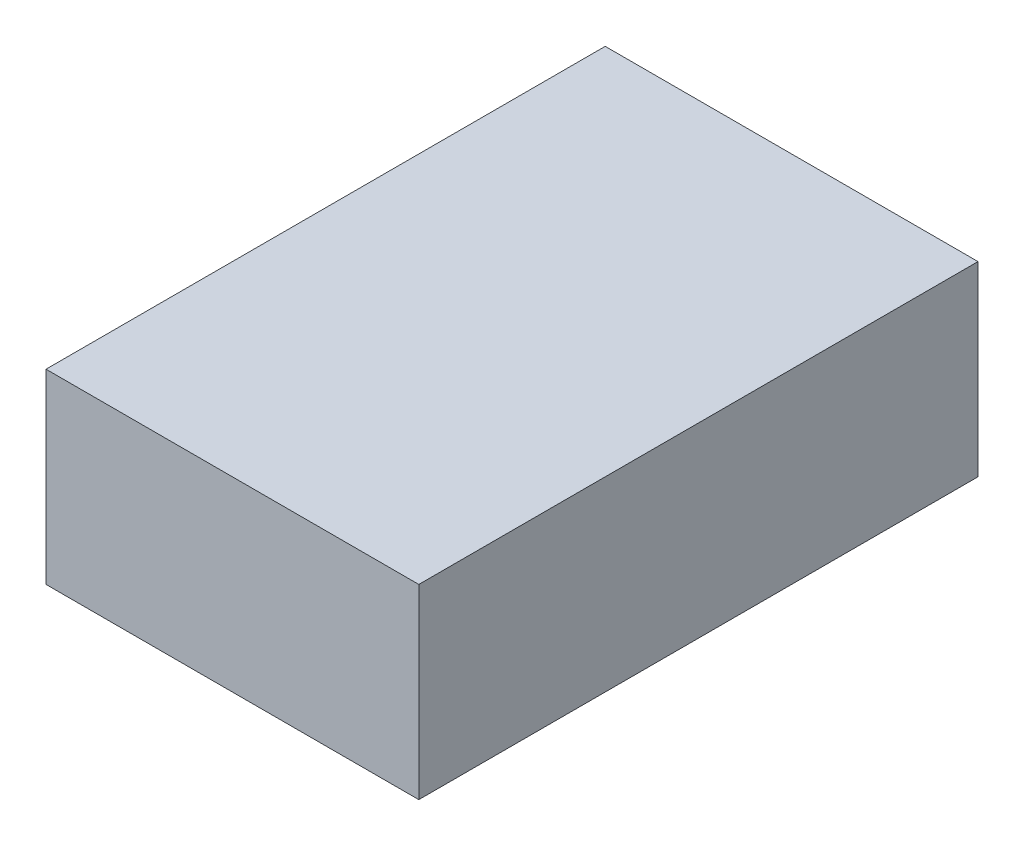
ISO-10303-21;
HEADER;
FILE_DESCRIPTION(('STEP AP214'),'2;1');
FILE_NAME('part.step','',(''),(''),'','','');
FILE_SCHEMA(('AUTOMOTIVE_DESIGN { 1 0 10303 214 1 1 1 1 }'));
ENDSEC;
DATA;
#1=APPLICATION_CONTEXT('core data for automotive mechanical design processes');
#2=APPLICATION_PROTOCOL_DEFINITION('international standard','automotive_design',2000,#1);
#3=PRODUCT_CONTEXT('',#1,'mechanical');
#4=PRODUCT('Part','Part','',(#3));
#5=PRODUCT_RELATED_PRODUCT_CATEGORY('part','',(#4));
#6=PRODUCT_DEFINITION_FORMATION('','',#4);
#7=PRODUCT_DEFINITION_CONTEXT('part definition',#1,'design');
#8=PRODUCT_DEFINITION('design','',#6,#7);
#9=PRODUCT_DEFINITION_SHAPE('','',#8);
#10=(LENGTH_UNIT() NAMED_UNIT(*) SI_UNIT(.MILLI.,.METRE.));
#11=(NAMED_UNIT(*) PLANE_ANGLE_UNIT() SI_UNIT($,.RADIAN.));
#12=(NAMED_UNIT(*) SI_UNIT($,.STERADIAN.) SOLID_ANGLE_UNIT());
#13=UNCERTAINTY_MEASURE_WITH_UNIT(LENGTH_MEASURE(1.E-05),#10,'distance_accuracy_value','');
#14=(GEOMETRIC_REPRESENTATION_CONTEXT(3) GLOBAL_UNCERTAINTY_ASSIGNED_CONTEXT((#13)) GLOBAL_UNIT_ASSIGNED_CONTEXT((#10,
#11,#12)) REPRESENTATION_CONTEXT('',''));
#15=CARTESIAN_POINT('',(0.,0.,0.));
#16=DIRECTION('',(0.,0.,1.));
#17=DIRECTION('',(1.,0.,0.));
#18=AXIS2_PLACEMENT_3D('',#15,#16,#17);
#19=CARTESIAN_POINT('',(100.,50.,300.));
#20=DIRECTION('',(-1.,0.,0.));
#21=DIRECTION('',(0.,-1.,0.));
#22=AXIS2_PLACEMENT_3D('',#19,#20,#21);
#23=PLANE('',#22);
#24=DIRECTION('',(0.,1.,0.));
#25=VECTOR('',#24,1.);
#26=CARTESIAN_POINT('',(100.,50.,0.));
#27=LINE('',#26,#25);
#28=CARTESIAN_POINT('',(100.,-50.,0.));
#29=VERTEX_POINT('',#28);
#30=CARTESIAN_POINT('',(100.,50.,0.));
#31=VERTEX_POINT('',#30);
#32=EDGE_CURVE('E103',#29,#31,#27,.T.);
#33=ORIENTED_EDGE('',*,*,#32,.T.);
#34=DIRECTION('',(0.,0.,-1.));
#35=VECTOR('',#34,1.);
#36=CARTESIAN_POINT('',(100.,50.,300.));
#37=LINE('',#36,#35);
#38=CARTESIAN_POINT('',(100.,50.,300.));
#39=VERTEX_POINT('',#38);
#40=EDGE_CURVE('E11',#39,#31,#37,.T.);
#41=ORIENTED_EDGE('',*,*,#40,.F.);
#42=DIRECTION('',(0.,1.,0.));
#43=VECTOR('',#42,1.);
#44=CARTESIAN_POINT('',(100.,50.,300.));
#45=LINE('',#44,#43);
#46=CARTESIAN_POINT('',(100.,-50.,300.));
#47=VERTEX_POINT('',#46);
#48=EDGE_CURVE('E91',#47,#39,#45,.T.);
#49=ORIENTED_EDGE('',*,*,#48,.F.);
#50=DIRECTION('',(0.,0.,-1.));
#51=VECTOR('',#50,1.);
#52=CARTESIAN_POINT('',(100.,-50.,300.));
#53=LINE('',#52,#51);
#54=EDGE_CURVE('E99',#47,#29,#53,.T.);
#55=ORIENTED_EDGE('',*,*,#54,.T.);
#56=EDGE_LOOP('',(#33,#41,#49,#55));
#57=FACE_BOUND('',#56,.T.);
#58=ADVANCED_FACE('F40',(#57),#23,.F.);
#59=CARTESIAN_POINT('',(-100.,50.,300.));
#60=DIRECTION('',(0.,-1.,0.));
#61=DIRECTION('',(0.,0.,-1.));
#62=AXIS2_PLACEMENT_3D('',#59,#60,#61);
#63=PLANE('',#62);
#64=DIRECTION('',(-1.,0.,0.));
#65=VECTOR('',#64,1.);
#66=CARTESIAN_POINT('',(-100.,50.,0.));
#67=LINE('',#66,#65);
#68=CARTESIAN_POINT('',(-100.,50.,0.));
#69=VERTEX_POINT('',#68);
#70=EDGE_CURVE('E95',#31,#69,#67,.T.);
#71=ORIENTED_EDGE('',*,*,#70,.T.);
#72=DIRECTION('',(0.,0.,-1.));
#73=VECTOR('',#72,1.);
#74=CARTESIAN_POINT('',(-100.,50.,300.));
#75=LINE('',#74,#73);
#76=CARTESIAN_POINT('',(-100.,50.,300.));
#77=VERTEX_POINT('',#76);
#78=EDGE_CURVE('E48',#77,#69,#75,.T.);
#79=ORIENTED_EDGE('',*,*,#78,.F.);
#80=DIRECTION('',(-1.,0.,0.));
#81=VECTOR('',#80,1.);
#82=CARTESIAN_POINT('',(-100.,50.,300.));
#83=LINE('',#82,#81);
#84=EDGE_CURVE('E86',#39,#77,#83,.T.);
#85=ORIENTED_EDGE('',*,*,#84,.F.);
#86=ORIENTED_EDGE('',*,*,#40,.T.);
#87=EDGE_LOOP('',(#71,#79,#85,#86));
#88=FACE_BOUND('',#87,.T.);
#89=ADVANCED_FACE('F94',(#88),#63,.F.);
#90=CARTESIAN_POINT('',(-100.,50.,300.));
#91=DIRECTION('',(1.,0.,0.));
#92=DIRECTION('',(0.,1.,0.));
#93=AXIS2_PLACEMENT_3D('',#90,#91,#92);
#94=PLANE('',#93);
#95=DIRECTION('',(0.,-1.,0.));
#96=VECTOR('',#95,1.);
#97=CARTESIAN_POINT('',(-100.,50.,0.));
#98=LINE('',#97,#96);
#99=CARTESIAN_POINT('',(-100.,-50.,0.));
#100=VERTEX_POINT('',#99);
#101=EDGE_CURVE('E73',#69,#100,#98,.T.);
#102=ORIENTED_EDGE('',*,*,#101,.T.);
#103=DIRECTION('',(0.,0.,-1.));
#104=VECTOR('',#103,1.);
#105=CARTESIAN_POINT('',(-100.,-50.,300.));
#106=LINE('',#105,#104);
#107=CARTESIAN_POINT('',(-100.,-50.,300.));
#108=VERTEX_POINT('',#107);
#109=EDGE_CURVE('E96',#108,#100,#106,.T.);
#110=ORIENTED_EDGE('',*,*,#109,.F.);
#111=DIRECTION('',(0.,-1.,0.));
#112=VECTOR('',#111,1.);
#113=CARTESIAN_POINT('',(-100.,50.,300.));
#114=LINE('',#113,#112);
#115=EDGE_CURVE('E89',#77,#108,#114,.T.);
#116=ORIENTED_EDGE('',*,*,#115,.F.);
#117=ORIENTED_EDGE('',*,*,#78,.T.);
#118=EDGE_LOOP('',(#102,#110,#116,#117));
#119=FACE_BOUND('',#118,.T.);
#120=ADVANCED_FACE('F97',(#119),#94,.F.);
#121=CARTESIAN_POINT('',(-100.,-50.,300.));
#122=DIRECTION('',(0.,1.,0.));
#123=DIRECTION('',(0.,0.,1.));
#124=AXIS2_PLACEMENT_3D('',#121,#122,#123);
#125=PLANE('',#124);
#126=DIRECTION('',(1.,0.,0.));
#127=VECTOR('',#126,1.);
#128=CARTESIAN_POINT('',(-100.,-50.,0.));
#129=LINE('',#128,#127);
#130=EDGE_CURVE('E79',#100,#29,#129,.T.);
#131=ORIENTED_EDGE('',*,*,#130,.T.);
#132=ORIENTED_EDGE('',*,*,#54,.F.);
#133=DIRECTION('',(1.,0.,0.));
#134=VECTOR('',#133,1.);
#135=CARTESIAN_POINT('',(-100.,-50.,300.));
#136=LINE('',#135,#134);
#137=EDGE_CURVE('E56',#108,#47,#136,.T.);
#138=ORIENTED_EDGE('',*,*,#137,.F.);
#139=ORIENTED_EDGE('',*,*,#109,.T.);
#140=EDGE_LOOP('',(#131,#132,#138,#139));
#141=FACE_BOUND('',#140,.T.);
#142=ADVANCED_FACE('F110',(#141),#125,.F.);
#143=CARTESIAN_POINT('',(0.,0.,300.));
#144=DIRECTION('',(0.,0.,1.));
#145=DIRECTION('',(1.,0.,0.));
#146=AXIS2_PLACEMENT_3D('',#143,#144,#145);
#147=PLANE('',#146);
#148=ORIENTED_EDGE('',*,*,#48,.T.);
#149=ORIENTED_EDGE('',*,*,#84,.T.);
#150=ORIENTED_EDGE('',*,*,#115,.T.);
#151=ORIENTED_EDGE('',*,*,#137,.T.);
#152=EDGE_LOOP('',(#148,#149,#150,#151));
#153=FACE_BOUND('',#152,.T.);
#154=ADVANCED_FACE('F87',(#153),#147,.T.);
#155=CARTESIAN_POINT('',(0.,0.,0.));
#156=DIRECTION('',(0.,0.,1.));
#157=DIRECTION('',(1.,0.,0.));
#158=AXIS2_PLACEMENT_3D('',#155,#156,#157);
#159=PLANE('',#158);
#160=ORIENTED_EDGE('',*,*,#32,.F.);
#161=ORIENTED_EDGE('',*,*,#130,.F.);
#162=ORIENTED_EDGE('',*,*,#101,.F.);
#163=ORIENTED_EDGE('',*,*,#70,.F.);
#164=EDGE_LOOP('',(#160,#161,#162,#163));
#165=FACE_BOUND('',#164,.T.);
#166=ADVANCED_FACE('F113',(#165),#159,.F.);
#167=CLOSED_SHELL('',(#58,#89,#120,#142,#154,#166));
#168=MANIFOLD_SOLID_BREP('B2',#167);
#169=ADVANCED_BREP_SHAPE_REPRESENTATION('',(#18,#168),#14);
#170=SHAPE_DEFINITION_REPRESENTATION(#9,#169);
ENDSEC;
END-ISO-10303-21;
